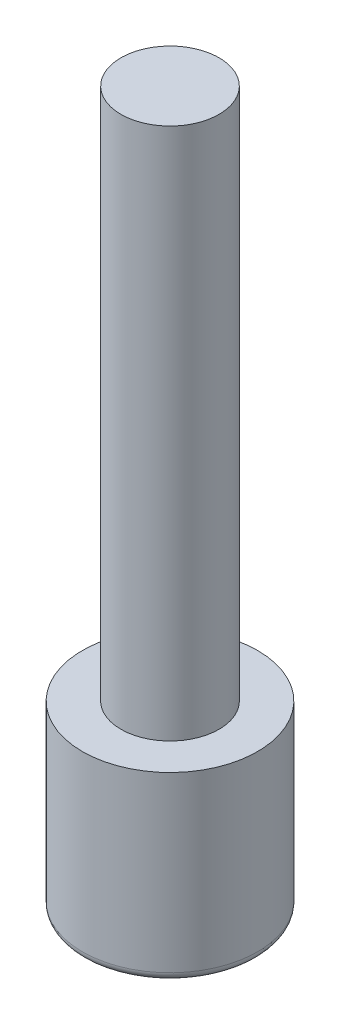
ISO-10303-21;
HEADER;
FILE_DESCRIPTION(('STEP AP214'),'2;1');
FILE_NAME('part.step','',(''),(''),'','','');
FILE_SCHEMA(('AUTOMOTIVE_DESIGN { 1 0 10303 214 1 1 1 1 }'));
ENDSEC;
DATA;
#1=APPLICATION_CONTEXT('core data for automotive mechanical design processes');
#2=APPLICATION_PROTOCOL_DEFINITION('international standard','automotive_design',2000,#1);
#3=PRODUCT_CONTEXT('',#1,'mechanical');
#4=PRODUCT('Part','Part','',(#3));
#5=PRODUCT_RELATED_PRODUCT_CATEGORY('part','',(#4));
#6=PRODUCT_DEFINITION_FORMATION('','',#4);
#7=PRODUCT_DEFINITION_CONTEXT('part definition',#1,'design');
#8=PRODUCT_DEFINITION('design','',#6,#7);
#9=PRODUCT_DEFINITION_SHAPE('','',#8);
#10=(LENGTH_UNIT() NAMED_UNIT(*) SI_UNIT(.MILLI.,.METRE.));
#11=(NAMED_UNIT(*) PLANE_ANGLE_UNIT() SI_UNIT($,.RADIAN.));
#12=(NAMED_UNIT(*) SI_UNIT($,.STERADIAN.) SOLID_ANGLE_UNIT());
#13=UNCERTAINTY_MEASURE_WITH_UNIT(LENGTH_MEASURE(1.E-05),#10,'distance_accuracy_value','');
#14=(GEOMETRIC_REPRESENTATION_CONTEXT(3) GLOBAL_UNCERTAINTY_ASSIGNED_CONTEXT((#13)) GLOBAL_UNIT_ASSIGNED_CONTEXT((#10,
#11,#12)) REPRESENTATION_CONTEXT('',''));
#15=CARTESIAN_POINT('',(0.,0.,0.));
#16=DIRECTION('',(0.,0.,1.));
#17=DIRECTION('',(1.,0.,0.));
#18=AXIS2_PLACEMENT_3D('',#15,#16,#17);
#19=CARTESIAN_POINT('',(0.,0.,0.));
#20=DIRECTION('',(0.,1.,0.));
#21=DIRECTION('',(0.,0.,1.));
#22=AXIS2_PLACEMENT_3D('',#19,#20,#21);
#23=PLANE('',#22);
#24=CARTESIAN_POINT('',(0.,0.,0.));
#25=DIRECTION('',(0.,1.,0.));
#26=DIRECTION('',(0.,0.,1.));
#27=AXIS2_PLACEMENT_3D('',#24,#25,#26);
#28=CIRCLE('',#27,2.25);
#29=CARTESIAN_POINT('',(0.,0.,2.25));
#30=VERTEX_POINT('',#29);
#31=EDGE_CURVE('E10',#30,#30,#28,.F.);
#32=ORIENTED_EDGE('',*,*,#31,.T.);
#33=EDGE_LOOP('',(#32));
#34=FACE_BOUND('',#33,.T.);
#35=ADVANCED_FACE('F43',(#34),#23,.F.);
#36=CARTESIAN_POINT('',(0.,20.4,0.));
#37=DIRECTION('',(0.,1.,0.));
#38=DIRECTION('',(0.,0.,1.));
#39=AXIS2_PLACEMENT_3D('',#36,#37,#38);
#40=CYLINDRICAL_SURFACE('',#39,2.5);
#41=CARTESIAN_POINT('',(0.,0.25,0.));
#42=DIRECTION('',(0.,1.,0.));
#43=DIRECTION('',(0.,0.,1.));
#44=AXIS2_PLACEMENT_3D('',#41,#42,#43);
#45=CIRCLE('',#44,2.5);
#46=CARTESIAN_POINT('',(0.,0.25,2.5));
#47=VERTEX_POINT('',#46);
#48=EDGE_CURVE('E51',#47,#47,#45,.T.);
#49=ORIENTED_EDGE('',*,*,#48,.T.);
#50=EDGE_LOOP('',(#49));
#51=FACE_BOUND('',#50,.T.);
#52=CARTESIAN_POINT('',(0.,5.2,0.));
#53=DIRECTION('',(0.,1.,0.));
#54=DIRECTION('',(0.,0.,1.));
#55=AXIS2_PLACEMENT_3D('',#52,#53,#54);
#56=CIRCLE('',#55,2.5);
#57=CARTESIAN_POINT('',(0.,5.2,2.5));
#58=VERTEX_POINT('',#57);
#59=EDGE_CURVE('E56',#58,#58,#56,.T.);
#60=ORIENTED_EDGE('',*,*,#59,.F.);
#61=EDGE_LOOP('',(#60));
#62=FACE_BOUND('',#61,.T.);
#63=ADVANCED_FACE('F83',(#51,#62),#40,.T.);
#64=CARTESIAN_POINT('',(0.,5.2,-2.5));
#65=DIRECTION('',(0.,-1.,0.));
#66=DIRECTION('',(0.,0.,-1.));
#67=AXIS2_PLACEMENT_3D('',#64,#65,#66);
#68=PLANE('',#67);
#69=CARTESIAN_POINT('',(0.,5.2,0.));
#70=DIRECTION('',(0.,1.,0.));
#71=DIRECTION('',(0.,0.,1.));
#72=AXIS2_PLACEMENT_3D('',#69,#70,#71);
#73=CIRCLE('',#72,1.4);
#74=CARTESIAN_POINT('',(0.,5.2,1.4));
#75=VERTEX_POINT('',#74);
#76=EDGE_CURVE('E61',#75,#75,#73,.T.);
#77=ORIENTED_EDGE('',*,*,#76,.F.);
#78=EDGE_LOOP('',(#77));
#79=FACE_BOUND('',#78,.T.);
#80=ORIENTED_EDGE('',*,*,#59,.T.);
#81=EDGE_LOOP('',(#80));
#82=FACE_BOUND('',#81,.T.);
#83=ADVANCED_FACE('F77',(#79,#82),#68,.F.);
#84=CARTESIAN_POINT('',(0.,20.4,0.));
#85=DIRECTION('',(0.,1.,0.));
#86=DIRECTION('',(0.,0.,1.));
#87=AXIS2_PLACEMENT_3D('',#84,#85,#86);
#88=CYLINDRICAL_SURFACE('',#87,1.4);
#89=CARTESIAN_POINT('',(0.,20.4,0.));
#90=DIRECTION('',(0.,1.,0.));
#91=DIRECTION('',(0.,0.,1.));
#92=AXIS2_PLACEMENT_3D('',#89,#90,#91);
#93=CIRCLE('',#92,1.4);
#94=CARTESIAN_POINT('',(0.,20.4,1.4));
#95=VERTEX_POINT('',#94);
#96=EDGE_CURVE('E67',#95,#95,#93,.T.);
#97=ORIENTED_EDGE('',*,*,#96,.F.);
#98=EDGE_LOOP('',(#97));
#99=FACE_BOUND('',#98,.T.);
#100=ORIENTED_EDGE('',*,*,#76,.T.);
#101=EDGE_LOOP('',(#100));
#102=FACE_BOUND('',#101,.T.);
#103=ADVANCED_FACE('F74',(#99,#102),#88,.T.);
#104=CARTESIAN_POINT('',(0.,20.4,-1.4));
#105=DIRECTION('',(0.,-1.,0.));
#106=DIRECTION('',(0.,0.,-1.));
#107=AXIS2_PLACEMENT_3D('',#104,#105,#106);
#108=PLANE('',#107);
#109=ORIENTED_EDGE('',*,*,#96,.T.);
#110=EDGE_LOOP('',(#109));
#111=FACE_BOUND('',#110,.T.);
#112=ADVANCED_FACE('F72',(#111),#108,.F.);
#113=CARTESIAN_POINT('',(0.,0.25,0.));
#114=DIRECTION('',(0.,1.,0.));
#115=DIRECTION('',(0.,0.,1.));
#116=AXIS2_PLACEMENT_3D('',#113,#114,#115);
#117=TOROIDAL_SURFACE('',#116,2.25,0.25);
#118=ORIENTED_EDGE('',*,*,#31,.F.);
#119=EDGE_LOOP('',(#118));
#120=FACE_BOUND('',#119,.T.);
#121=ORIENTED_EDGE('',*,*,#48,.F.);
#122=EDGE_LOOP('',(#121));
#123=FACE_BOUND('',#122,.T.);
#124=ADVANCED_FACE('F45',(#120,#123),#117,.T.);
#125=CLOSED_SHELL('',(#35,#63,#83,#103,#112,#124));
#126=MANIFOLD_SOLID_BREP('B2',#125);
#127=ADVANCED_BREP_SHAPE_REPRESENTATION('',(#18,#126),#14);
#128=SHAPE_DEFINITION_REPRESENTATION(#9,#127);
ENDSEC;
END-ISO-10303-21;
